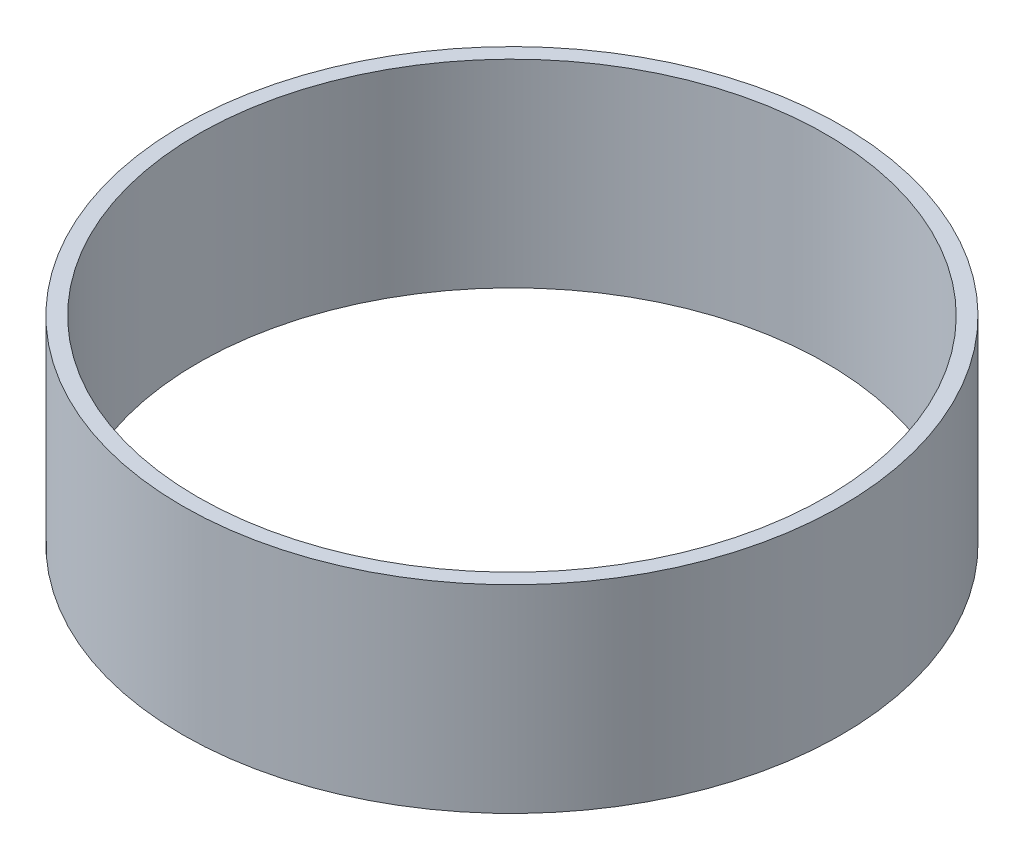
ISO-10303-21;
HEADER;
FILE_DESCRIPTION(('STEP AP214'),'2;1');
FILE_NAME('part.step','',(''),(''),'','','');
FILE_SCHEMA(('AUTOMOTIVE_DESIGN { 1 0 10303 214 1 1 1 1 }'));
ENDSEC;
DATA;
#1=APPLICATION_CONTEXT('core data for automotive mechanical design processes');
#2=APPLICATION_PROTOCOL_DEFINITION('international standard','automotive_design',2000,#1);
#3=PRODUCT_CONTEXT('',#1,'mechanical');
#4=PRODUCT('Part','Part','',(#3));
#5=PRODUCT_RELATED_PRODUCT_CATEGORY('part','',(#4));
#6=PRODUCT_DEFINITION_FORMATION('','',#4);
#7=PRODUCT_DEFINITION_CONTEXT('part definition',#1,'design');
#8=PRODUCT_DEFINITION('design','',#6,#7);
#9=PRODUCT_DEFINITION_SHAPE('','',#8);
#10=(LENGTH_UNIT() NAMED_UNIT(*) SI_UNIT(.MILLI.,.METRE.));
#11=(NAMED_UNIT(*) PLANE_ANGLE_UNIT() SI_UNIT($,.RADIAN.));
#12=(NAMED_UNIT(*) SI_UNIT($,.STERADIAN.) SOLID_ANGLE_UNIT());
#13=UNCERTAINTY_MEASURE_WITH_UNIT(LENGTH_MEASURE(1.E-05),#10,'distance_accuracy_value','');
#14=(GEOMETRIC_REPRESENTATION_CONTEXT(3) GLOBAL_UNCERTAINTY_ASSIGNED_CONTEXT((#13)) GLOBAL_UNIT_ASSIGNED_CONTEXT((#10,
#11,#12)) REPRESENTATION_CONTEXT('',''));
#15=CARTESIAN_POINT('',(0.,0.,0.));
#16=DIRECTION('',(0.,0.,1.));
#17=DIRECTION('',(1.,0.,0.));
#18=AXIS2_PLACEMENT_3D('',#15,#16,#17);
#19=CARTESIAN_POINT('',(0.,22.8981,0.));
#20=DIRECTION('',(0.,1.,0.));
#21=DIRECTION('',(0.,0.,1.));
#22=AXIS2_PLACEMENT_3D('',#19,#20,#21);
#23=PLANE('',#22);
#24=CARTESIAN_POINT('',(0.,22.8981,0.));
#25=DIRECTION('',(0.,1.,0.));
#26=DIRECTION('',(0.,0.,1.));
#27=AXIS2_PLACEMENT_3D('',#24,#25,#26);
#28=CIRCLE('',#27,38.1);
#29=CARTESIAN_POINT('',(0.,22.8981,38.1));
#30=VERTEX_POINT('',#29);
#31=EDGE_CURVE('E10',#30,#30,#28,.T.);
#32=ORIENTED_EDGE('',*,*,#31,.T.);
#33=EDGE_LOOP('',(#32));
#34=FACE_BOUND('',#33,.T.);
#35=CARTESIAN_POINT('',(0.,22.8981,0.));
#36=DIRECTION('',(0.,1.,0.));
#37=DIRECTION('',(0.,0.,1.));
#38=AXIS2_PLACEMENT_3D('',#35,#36,#37);
#39=CIRCLE('',#38,36.322);
#40=CARTESIAN_POINT('',(0.,22.8981,36.322));
#41=VERTEX_POINT('',#40);
#42=EDGE_CURVE('E52',#41,#41,#39,.T.);
#43=ORIENTED_EDGE('',*,*,#42,.F.);
#44=EDGE_LOOP('',(#43));
#45=FACE_BOUND('',#44,.T.);
#46=ADVANCED_FACE('F39',(#34,#45),#23,.T.);
#47=CARTESIAN_POINT('',(0.,0.,0.));
#48=DIRECTION('',(0.,1.,0.));
#49=DIRECTION('',(0.,0.,1.));
#50=AXIS2_PLACEMENT_3D('',#47,#48,#49);
#51=PLANE('',#50);
#52=CARTESIAN_POINT('',(0.,0.,0.));
#53=DIRECTION('',(0.,1.,0.));
#54=DIRECTION('',(0.,0.,1.));
#55=AXIS2_PLACEMENT_3D('',#52,#53,#54);
#56=CIRCLE('',#55,38.1);
#57=CARTESIAN_POINT('',(0.,0.,38.1));
#58=VERTEX_POINT('',#57);
#59=EDGE_CURVE('E43',#58,#58,#56,.T.);
#60=ORIENTED_EDGE('',*,*,#59,.F.);
#61=EDGE_LOOP('',(#60));
#62=FACE_BOUND('',#61,.T.);
#63=CARTESIAN_POINT('',(0.,0.,0.));
#64=DIRECTION('',(0.,1.,0.));
#65=DIRECTION('',(0.,0.,1.));
#66=AXIS2_PLACEMENT_3D('',#63,#64,#65);
#67=CIRCLE('',#66,36.322);
#68=CARTESIAN_POINT('',(0.,0.,36.322));
#69=VERTEX_POINT('',#68);
#70=EDGE_CURVE('E54',#69,#69,#67,.T.);
#71=ORIENTED_EDGE('',*,*,#70,.T.);
#72=EDGE_LOOP('',(#71));
#73=FACE_BOUND('',#72,.T.);
#74=ADVANCED_FACE('F66',(#62,#73),#51,.F.);
#75=CARTESIAN_POINT('',(0.,22.8981,0.));
#76=DIRECTION('',(0.,-1.,0.));
#77=DIRECTION('',(0.,0.,-1.));
#78=AXIS2_PLACEMENT_3D('',#75,#76,#77);
#79=CYLINDRICAL_SURFACE('',#78,38.1);
#80=ORIENTED_EDGE('',*,*,#31,.F.);
#81=EDGE_LOOP('',(#80));
#82=FACE_BOUND('',#81,.T.);
#83=ORIENTED_EDGE('',*,*,#59,.T.);
#84=EDGE_LOOP('',(#83));
#85=FACE_BOUND('',#84,.T.);
#86=ADVANCED_FACE('F41',(#82,#85),#79,.T.);
#87=CARTESIAN_POINT('',(0.,22.8981,0.));
#88=DIRECTION('',(0.,-1.,0.));
#89=DIRECTION('',(0.,0.,-1.));
#90=AXIS2_PLACEMENT_3D('',#87,#88,#89);
#91=CYLINDRICAL_SURFACE('',#90,36.322);
#92=ORIENTED_EDGE('',*,*,#42,.T.);
#93=EDGE_LOOP('',(#92));
#94=FACE_BOUND('',#93,.T.);
#95=ORIENTED_EDGE('',*,*,#70,.F.);
#96=EDGE_LOOP('',(#95));
#97=FACE_BOUND('',#96,.T.);
#98=ADVANCED_FACE('F62',(#94,#97),#91,.F.);
#99=CLOSED_SHELL('',(#46,#74,#86,#98));
#100=MANIFOLD_SOLID_BREP('B2',#99);
#101=ADVANCED_BREP_SHAPE_REPRESENTATION('',(#18,#100),#14);
#102=SHAPE_DEFINITION_REPRESENTATION(#9,#101);
ENDSEC;
END-ISO-10303-21;
